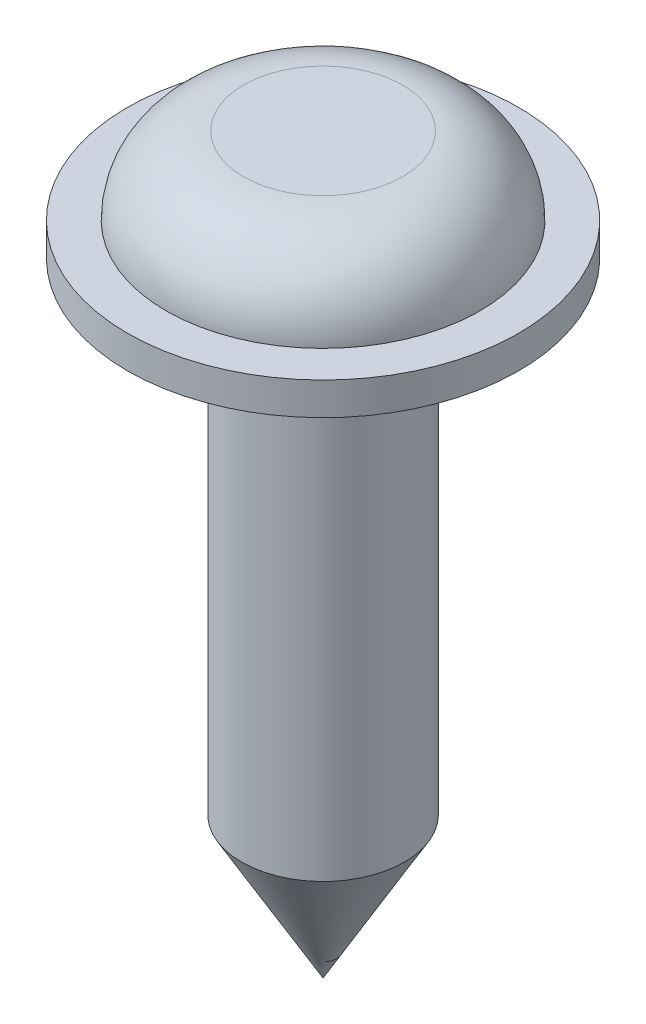
ISO-10303-21;
HEADER;
FILE_DESCRIPTION(('STEP AP214'),'2;1');
FILE_NAME('part.step','',(''),(''),'','','');
FILE_SCHEMA(('AUTOMOTIVE_DESIGN { 1 0 10303 214 1 1 1 1 }'));
ENDSEC;
DATA;
#1=APPLICATION_CONTEXT('core data for automotive mechanical design processes');
#2=APPLICATION_PROTOCOL_DEFINITION('international standard','automotive_design',2000,#1);
#3=PRODUCT_CONTEXT('',#1,'mechanical');
#4=PRODUCT('Part','Part','',(#3));
#5=PRODUCT_RELATED_PRODUCT_CATEGORY('part','',(#4));
#6=PRODUCT_DEFINITION_FORMATION('','',#4);
#7=PRODUCT_DEFINITION_CONTEXT('part definition',#1,'design');
#8=PRODUCT_DEFINITION('design','',#6,#7);
#9=PRODUCT_DEFINITION_SHAPE('','',#8);
#10=(LENGTH_UNIT() NAMED_UNIT(*) SI_UNIT(.MILLI.,.METRE.));
#11=(NAMED_UNIT(*) PLANE_ANGLE_UNIT() SI_UNIT($,.RADIAN.));
#12=(NAMED_UNIT(*) SI_UNIT($,.STERADIAN.) SOLID_ANGLE_UNIT());
#13=UNCERTAINTY_MEASURE_WITH_UNIT(LENGTH_MEASURE(1.E-05),#10,'distance_accuracy_value','');
#14=(GEOMETRIC_REPRESENTATION_CONTEXT(3) GLOBAL_UNCERTAINTY_ASSIGNED_CONTEXT((#13)) GLOBAL_UNIT_ASSIGNED_CONTEXT((#10,
#11,#12)) REPRESENTATION_CONTEXT('',''));
#15=CARTESIAN_POINT('',(0.,0.,0.));
#16=DIRECTION('',(0.,0.,1.));
#17=DIRECTION('',(1.,0.,0.));
#18=AXIS2_PLACEMENT_3D('',#15,#16,#17);
#19=CARTESIAN_POINT('',(0.,0.,0.));
#20=DIRECTION('',(0.,1.,0.));
#21=DIRECTION('',(0.,0.,1.));
#22=AXIS2_PLACEMENT_3D('',#19,#20,#21);
#23=CONICAL_SURFACE('',#22,0.,0.5235987755983);
#24=CARTESIAN_POINT('',(0.,1.73205080756887,0.));
#25=DIRECTION('',(0.,1.,0.));
#26=DIRECTION('',(0.,0.,1.));
#27=AXIS2_PLACEMENT_3D('',#24,#25,#26);
#28=CIRCLE('',#27,1.);
#29=CARTESIAN_POINT('',(0.,1.73205080756887,1.));
#30=VERTEX_POINT('',#29);
#31=EDGE_CURVE('E11',#30,#30,#28,.T.);
#32=ORIENTED_EDGE('',*,*,#31,.F.);
#33=EDGE_LOOP('',(#32));
#34=FACE_BOUND('',#33,.T.);
#35=CARTESIAN_POINT('',(0.,0.,0.));
#36=VERTEX_POINT('',#35);
#37=VERTEX_LOOP('',#36);
#38=FACE_BOUND('',#37,.T.);
#39=ADVANCED_FACE('F37',(#34,#38),#23,.T.);
#40=CARTESIAN_POINT('',(0.,9.,0.));
#41=DIRECTION('',(0.,1.,0.));
#42=DIRECTION('',(0.,0.,1.));
#43=AXIS2_PLACEMENT_3D('',#40,#41,#42);
#44=CYLINDRICAL_SURFACE('',#43,1.);
#45=CARTESIAN_POINT('',(0.,7.65,0.));
#46=DIRECTION('',(0.,1.,0.));
#47=DIRECTION('',(0.,0.,1.));
#48=AXIS2_PLACEMENT_3D('',#45,#46,#47);
#49=CIRCLE('',#48,1.);
#50=CARTESIAN_POINT('',(0.,7.65,1.));
#51=VERTEX_POINT('',#50);
#52=EDGE_CURVE('E43',#51,#51,#49,.T.);
#53=ORIENTED_EDGE('',*,*,#52,.F.);
#54=EDGE_LOOP('',(#53));
#55=FACE_BOUND('',#54,.T.);
#56=ORIENTED_EDGE('',*,*,#31,.T.);
#57=EDGE_LOOP('',(#56));
#58=FACE_BOUND('',#57,.T.);
#59=ADVANCED_FACE('F47',(#55,#58),#44,.T.);
#60=CARTESIAN_POINT('',(1.,7.65,0.));
#61=DIRECTION('',(0.,1.,0.));
#62=DIRECTION('',(0.,0.,1.));
#63=AXIS2_PLACEMENT_3D('',#60,#61,#62);
#64=PLANE('',#63);
#65=CARTESIAN_POINT('',(0.,7.65,0.));
#66=DIRECTION('',(0.,1.,0.));
#67=DIRECTION('',(0.,0.,1.));
#68=AXIS2_PLACEMENT_3D('',#65,#66,#67);
#69=CIRCLE('',#68,2.4);
#70=CARTESIAN_POINT('',(0.,7.65,2.4));
#71=VERTEX_POINT('',#70);
#72=EDGE_CURVE('E91',#71,#71,#69,.T.);
#73=ORIENTED_EDGE('',*,*,#72,.F.);
#74=EDGE_LOOP('',(#73));
#75=FACE_BOUND('',#74,.T.);
#76=ORIENTED_EDGE('',*,*,#52,.T.);
#77=EDGE_LOOP('',(#76));
#78=FACE_BOUND('',#77,.T.);
#79=ADVANCED_FACE('F52',(#75,#78),#64,.F.);
#80=CARTESIAN_POINT('',(0.,9.,0.));
#81=DIRECTION('',(0.,1.,0.));
#82=DIRECTION('',(0.,0.,1.));
#83=AXIS2_PLACEMENT_3D('',#80,#81,#82);
#84=CYLINDRICAL_SURFACE('',#83,2.4);
#85=CARTESIAN_POINT('',(0.,8.05,0.));
#86=DIRECTION('',(0.,1.,0.));
#87=DIRECTION('',(0.,0.,1.));
#88=AXIS2_PLACEMENT_3D('',#85,#86,#87);
#89=CIRCLE('',#88,2.4);
#90=CARTESIAN_POINT('',(0.,8.05,2.4));
#91=VERTEX_POINT('',#90);
#92=EDGE_CURVE('E86',#91,#91,#89,.T.);
#93=ORIENTED_EDGE('',*,*,#92,.F.);
#94=EDGE_LOOP('',(#93));
#95=FACE_BOUND('',#94,.T.);
#96=ORIENTED_EDGE('',*,*,#72,.T.);
#97=EDGE_LOOP('',(#96));
#98=FACE_BOUND('',#97,.T.);
#99=ADVANCED_FACE('F59',(#95,#98),#84,.T.);
#100=CARTESIAN_POINT('',(2.4,8.05,0.));
#101=DIRECTION('',(0.,-1.,0.));
#102=DIRECTION('',(0.,0.,-1.));
#103=AXIS2_PLACEMENT_3D('',#100,#101,#102);
#104=PLANE('',#103);
#105=CARTESIAN_POINT('',(0.,8.05,0.));
#106=DIRECTION('',(0.,1.,0.));
#107=DIRECTION('',(0.,0.,1.));
#108=AXIS2_PLACEMENT_3D('',#105,#106,#107);
#109=CIRCLE('',#108,1.925);
#110=CARTESIAN_POINT('',(0.,8.05,1.925));
#111=VERTEX_POINT('',#110);
#112=EDGE_CURVE('E83',#111,#111,#109,.T.);
#113=ORIENTED_EDGE('',*,*,#112,.F.);
#114=EDGE_LOOP('',(#113));
#115=FACE_BOUND('',#114,.T.);
#116=ORIENTED_EDGE('',*,*,#92,.T.);
#117=EDGE_LOOP('',(#116));
#118=FACE_BOUND('',#117,.T.);
#119=ADVANCED_FACE('F66',(#115,#118),#104,.F.);
#120=CARTESIAN_POINT('',(0.,8.05,0.));
#121=DIRECTION('',(0.,1.,0.));
#122=DIRECTION('',(0.,0.,1.));
#123=AXIS2_PLACEMENT_3D('',#120,#121,#122);
#124=TOROIDAL_SURFACE('',#123,0.975,0.95);
#125=CARTESIAN_POINT('',(0.,9.,0.));
#126=DIRECTION('',(0.,1.,0.));
#127=DIRECTION('',(0.,0.,1.));
#128=AXIS2_PLACEMENT_3D('',#125,#126,#127);
#129=CIRCLE('',#128,0.975);
#130=CARTESIAN_POINT('',(0.,9.,0.975));
#131=VERTEX_POINT('',#130);
#132=EDGE_CURVE('E82',#131,#131,#129,.T.);
#133=ORIENTED_EDGE('',*,*,#132,.F.);
#134=EDGE_LOOP('',(#133));
#135=FACE_BOUND('',#134,.T.);
#136=ORIENTED_EDGE('',*,*,#112,.T.);
#137=EDGE_LOOP('',(#136));
#138=FACE_BOUND('',#137,.T.);
#139=ADVANCED_FACE('F70',(#135,#138),#124,.T.);
#140=CARTESIAN_POINT('',(0.,9.,0.));
#141=DIRECTION('',(0.,-1.,0.));
#142=DIRECTION('',(0.,0.,-1.));
#143=AXIS2_PLACEMENT_3D('',#140,#141,#142);
#144=PLANE('',#143);
#145=ORIENTED_EDGE('',*,*,#132,.T.);
#146=EDGE_LOOP('',(#145));
#147=FACE_BOUND('',#146,.T.);
#148=ADVANCED_FACE('F74',(#147),#144,.F.);
#149=CLOSED_SHELL('',(#39,#59,#79,#99,#119,#139,#148));
#150=MANIFOLD_SOLID_BREP('B2',#149);
#151=ADVANCED_BREP_SHAPE_REPRESENTATION('',(#18,#150),#14);
#152=SHAPE_DEFINITION_REPRESENTATION(#9,#151);
ENDSEC;
END-ISO-10303-21;
